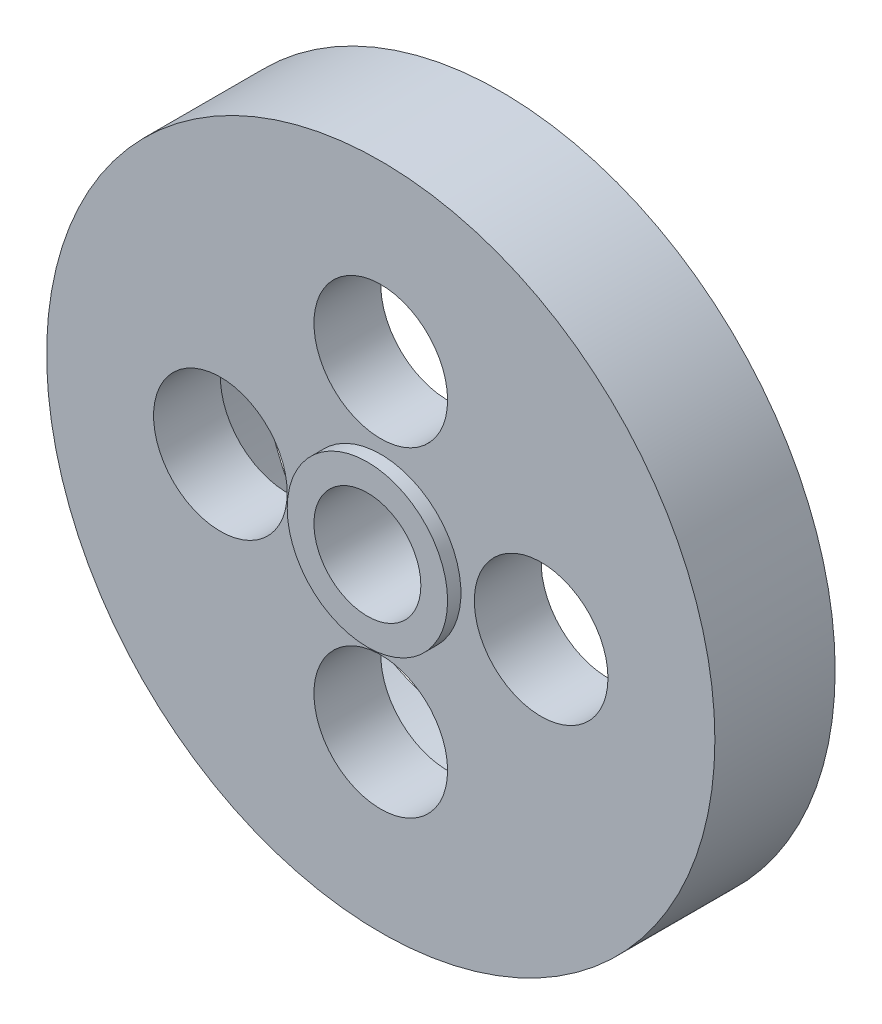
ISO-10303-21;
HEADER;
FILE_DESCRIPTION(('STEP AP214'),'2;1');
FILE_NAME('part.step','',(''),(''),'','','');
FILE_SCHEMA(('AUTOMOTIVE_DESIGN { 1 0 10303 214 1 1 1 1 }'));
ENDSEC;
DATA;
#1=APPLICATION_CONTEXT('core data for automotive mechanical design processes');
#2=APPLICATION_PROTOCOL_DEFINITION('international standard','automotive_design',2000,#1);
#3=PRODUCT_CONTEXT('',#1,'mechanical');
#4=PRODUCT('Part','Part','',(#3));
#5=PRODUCT_RELATED_PRODUCT_CATEGORY('part','',(#4));
#6=PRODUCT_DEFINITION_FORMATION('','',#4);
#7=PRODUCT_DEFINITION_CONTEXT('part definition',#1,'design');
#8=PRODUCT_DEFINITION('design','',#6,#7);
#9=PRODUCT_DEFINITION_SHAPE('','',#8);
#10=(LENGTH_UNIT() NAMED_UNIT(*) SI_UNIT(.MILLI.,.METRE.));
#11=(NAMED_UNIT(*) PLANE_ANGLE_UNIT() SI_UNIT($,.RADIAN.));
#12=(NAMED_UNIT(*) SI_UNIT($,.STERADIAN.) SOLID_ANGLE_UNIT());
#13=UNCERTAINTY_MEASURE_WITH_UNIT(LENGTH_MEASURE(1.E-05),#10,'distance_accuracy_value','');
#14=(GEOMETRIC_REPRESENTATION_CONTEXT(3) GLOBAL_UNCERTAINTY_ASSIGNED_CONTEXT((#13)) GLOBAL_UNIT_ASSIGNED_CONTEXT((#10,
#11,#12)) REPRESENTATION_CONTEXT('',''));
#15=CARTESIAN_POINT('',(0.,0.,0.));
#16=DIRECTION('',(0.,0.,1.));
#17=DIRECTION('',(1.,0.,0.));
#18=AXIS2_PLACEMENT_3D('',#15,#16,#17);
#19=CARTESIAN_POINT('',(0.,4.,-7.73906317836018));
#20=DIRECTION('',(0.,0.,-1.));
#21=DIRECTION('',(-1.,0.,0.));
#22=AXIS2_PLACEMENT_3D('',#19,#20,#21);
#23=PLANE('',#22);
#24=CARTESIAN_POINT('',(0.,0.,-7.73906317836018));
#25=DIRECTION('',(0.,0.,1.));
#26=DIRECTION('',(1.,0.,0.));
#27=AXIS2_PLACEMENT_3D('',#24,#25,#26);
#28=CIRCLE('',#27,25.);
#29=CARTESIAN_POINT('',(25.,0.,-7.73906317836018));
#30=VERTEX_POINT('',#29);
#31=EDGE_CURVE('E50',#30,#30,#28,.T.);
#32=ORIENTED_EDGE('',*,*,#31,.T.);
#33=EDGE_LOOP('',(#32));
#34=FACE_BOUND('',#33,.T.);
#35=CARTESIAN_POINT('',(-12.,0.,-7.73906317836018));
#36=DIRECTION('',(0.,0.,1.));
#37=DIRECTION('',(1.,0.,0.));
#38=AXIS2_PLACEMENT_3D('',#35,#36,#37);
#39=CIRCLE('',#38,5.00000000000015);
#40=CARTESIAN_POINT('',(-6.99999999999989,0.,-7.73906317836018));
#41=VERTEX_POINT('',#40);
#42=EDGE_CURVE('E85',#41,#41,#39,.T.);
#43=ORIENTED_EDGE('',*,*,#42,.F.);
#44=EDGE_LOOP('',(#43));
#45=FACE_BOUND('',#44,.T.);
#46=CARTESIAN_POINT('',(0.,-12.,-7.73906317836018));
#47=DIRECTION('',(0.,0.,1.));
#48=DIRECTION('',(1.,0.,0.));
#49=AXIS2_PLACEMENT_3D('',#46,#47,#48);
#50=CIRCLE('',#49,5.00000000000007);
#51=CARTESIAN_POINT('',(5.00000000000007,-12.,-7.73906317836018));
#52=VERTEX_POINT('',#51);
#53=EDGE_CURVE('E204',#52,#52,#50,.T.);
#54=ORIENTED_EDGE('',*,*,#53,.F.);
#55=EDGE_LOOP('',(#54));
#56=FACE_BOUND('',#55,.T.);
#57=CARTESIAN_POINT('',(12.,0.,-7.73906317836018));
#58=DIRECTION('',(0.,0.,1.));
#59=DIRECTION('',(1.,0.,0.));
#60=AXIS2_PLACEMENT_3D('',#57,#58,#59);
#61=CIRCLE('',#60,5.00000000000004);
#62=CARTESIAN_POINT('',(17.,0.,-7.73906317836018));
#63=VERTEX_POINT('',#62);
#64=EDGE_CURVE('E210',#63,#63,#61,.T.);
#65=ORIENTED_EDGE('',*,*,#64,.F.);
#66=EDGE_LOOP('',(#65));
#67=FACE_BOUND('',#66,.T.);
#68=CARTESIAN_POINT('',(0.,12.,-7.73906317836018));
#69=DIRECTION('',(0.,0.,1.));
#70=DIRECTION('',(1.,0.,0.));
#71=AXIS2_PLACEMENT_3D('',#68,#69,#70);
#72=CIRCLE('',#71,5.);
#73=CARTESIAN_POINT('',(5.,12.,-7.73906317836018));
#74=VERTEX_POINT('',#73);
#75=EDGE_CURVE('E67',#74,#74,#72,.T.);
#76=ORIENTED_EDGE('',*,*,#75,.F.);
#77=EDGE_LOOP('',(#76));
#78=FACE_BOUND('',#77,.T.);
#79=CARTESIAN_POINT('',(0.,0.,-7.73906317836018));
#80=DIRECTION('',(0.,0.,-1.));
#81=DIRECTION('',(-1.,0.,0.));
#82=AXIS2_PLACEMENT_3D('',#79,#80,#81);
#83=CIRCLE('',#82,6.);
#84=CARTESIAN_POINT('',(-6.,0.,-7.73906317836018));
#85=VERTEX_POINT('',#84);
#86=EDGE_CURVE('E10',#85,#85,#83,.F.);
#87=ORIENTED_EDGE('',*,*,#86,.F.);
#88=EDGE_LOOP('',(#87));
#89=FACE_BOUND('',#88,.T.);
#90=ADVANCED_FACE('F43',(#34,#45,#56,#67,#78,#89),#23,.F.);
#91=CARTESIAN_POINT('',(0.,0.,0.));
#92=DIRECTION('',(0.,0.,1.));
#93=DIRECTION('',(1.,0.,0.));
#94=AXIS2_PLACEMENT_3D('',#91,#92,#93);
#95=CYLINDRICAL_SURFACE('',#94,4.);
#96=CARTESIAN_POINT('',(0.,0.,-12.7390631783602));
#97=DIRECTION('',(0.,0.,1.));
#98=DIRECTION('',(1.,0.,0.));
#99=AXIS2_PLACEMENT_3D('',#96,#97,#98);
#100=CIRCLE('',#99,4.);
#101=CARTESIAN_POINT('',(4.,0.,-12.7390631783602));
#102=VERTEX_POINT('',#101);
#103=EDGE_CURVE('E74',#102,#102,#100,.T.);
#104=ORIENTED_EDGE('',*,*,#103,.F.);
#105=EDGE_LOOP('',(#104));
#106=FACE_BOUND('',#105,.T.);
#107=CARTESIAN_POINT('',(0.,0.,-6.73906317836018));
#108=DIRECTION('',(0.,0.,1.));
#109=DIRECTION('',(1.,0.,0.));
#110=AXIS2_PLACEMENT_3D('',#107,#108,#109);
#111=CIRCLE('',#110,4.);
#112=CARTESIAN_POINT('',(4.,0.,-6.73906317836018));
#113=VERTEX_POINT('',#112);
#114=EDGE_CURVE('E201',#113,#113,#111,.T.);
#115=ORIENTED_EDGE('',*,*,#114,.T.);
#116=EDGE_LOOP('',(#115));
#117=FACE_BOUND('',#116,.T.);
#118=ADVANCED_FACE('F45',(#106,#117),#95,.F.);
#119=CARTESIAN_POINT('',(0.,0.,0.));
#120=DIRECTION('',(0.,0.,1.));
#121=DIRECTION('',(1.,0.,0.));
#122=AXIS2_PLACEMENT_3D('',#119,#120,#121);
#123=CYLINDRICAL_SURFACE('',#122,25.);
#124=ORIENTED_EDGE('',*,*,#31,.F.);
#125=EDGE_LOOP('',(#124));
#126=FACE_BOUND('',#125,.T.);
#127=CARTESIAN_POINT('',(0.,0.,-16.7390631783602));
#128=DIRECTION('',(0.,0.,1.));
#129=DIRECTION('',(1.,0.,0.));
#130=AXIS2_PLACEMENT_3D('',#127,#128,#129);
#131=CIRCLE('',#130,25.);
#132=CARTESIAN_POINT('',(25.,0.,-16.7390631783602));
#133=VERTEX_POINT('',#132);
#134=EDGE_CURVE('E54',#133,#133,#131,.T.);
#135=ORIENTED_EDGE('',*,*,#134,.T.);
#136=EDGE_LOOP('',(#135));
#137=FACE_BOUND('',#136,.T.);
#138=ADVANCED_FACE('F115',(#126,#137),#123,.T.);
#139=CARTESIAN_POINT('',(0.,25.,-16.7390631783602));
#140=DIRECTION('',(0.,0.,1.));
#141=DIRECTION('',(1.,0.,0.));
#142=AXIS2_PLACEMENT_3D('',#139,#140,#141);
#143=PLANE('',#142);
#144=ORIENTED_EDGE('',*,*,#134,.F.);
#145=EDGE_LOOP('',(#144));
#146=FACE_BOUND('',#145,.T.);
#147=CARTESIAN_POINT('',(0.,0.,-16.7390631783602));
#148=DIRECTION('',(0.,0.,1.));
#149=DIRECTION('',(1.,0.,0.));
#150=AXIS2_PLACEMENT_3D('',#147,#148,#149);
#151=CIRCLE('',#150,18.);
#152=CARTESIAN_POINT('',(18.,0.,-16.7390631783602));
#153=VERTEX_POINT('',#152);
#154=EDGE_CURVE('E59',#153,#153,#151,.T.);
#155=ORIENTED_EDGE('',*,*,#154,.T.);
#156=EDGE_LOOP('',(#155));
#157=FACE_BOUND('',#156,.T.);
#158=ADVANCED_FACE('F90',(#146,#157),#143,.F.);
#159=CARTESIAN_POINT('',(0.,0.,0.));
#160=DIRECTION('',(0.,0.,1.));
#161=DIRECTION('',(1.,0.,0.));
#162=AXIS2_PLACEMENT_3D('',#159,#160,#161);
#163=CYLINDRICAL_SURFACE('',#162,18.);
#164=ORIENTED_EDGE('',*,*,#154,.F.);
#165=EDGE_LOOP('',(#164));
#166=FACE_BOUND('',#165,.T.);
#167=CARTESIAN_POINT('',(0.,0.,-12.7390631783602));
#168=DIRECTION('',(0.,0.,1.));
#169=DIRECTION('',(1.,0.,0.));
#170=AXIS2_PLACEMENT_3D('',#167,#168,#169);
#171=CIRCLE('',#170,18.);
#172=CARTESIAN_POINT('',(18.,0.,-12.7390631783602));
#173=VERTEX_POINT('',#172);
#174=EDGE_CURVE('E78',#173,#173,#171,.T.);
#175=ORIENTED_EDGE('',*,*,#174,.T.);
#176=EDGE_LOOP('',(#175));
#177=FACE_BOUND('',#176,.T.);
#178=ADVANCED_FACE('F92',(#166,#177),#163,.F.);
#179=CARTESIAN_POINT('',(0.,18.,-12.7390631783602));
#180=DIRECTION('',(0.,0.,1.));
#181=DIRECTION('',(1.,0.,0.));
#182=AXIS2_PLACEMENT_3D('',#179,#180,#181);
#183=PLANE('',#182);
#184=CARTESIAN_POINT('',(0.,12.,-12.7390631783602));
#185=DIRECTION('',(0.,0.,1.));
#186=DIRECTION('',(1.,0.,0.));
#187=AXIS2_PLACEMENT_3D('',#184,#185,#186);
#188=CIRCLE('',#187,5.);
#189=CARTESIAN_POINT('',(5.,12.,-12.7390631783602));
#190=VERTEX_POINT('',#189);
#191=EDGE_CURVE('E72',#190,#190,#188,.T.);
#192=ORIENTED_EDGE('',*,*,#191,.T.);
#193=EDGE_LOOP('',(#192));
#194=FACE_BOUND('',#193,.T.);
#195=CARTESIAN_POINT('',(12.,0.,-12.7390631783602));
#196=DIRECTION('',(0.,0.,1.));
#197=DIRECTION('',(1.,0.,0.));
#198=AXIS2_PLACEMENT_3D('',#195,#196,#197);
#199=CIRCLE('',#198,5.00000000000004);
#200=CARTESIAN_POINT('',(17.,0.,-12.7390631783602));
#201=VERTEX_POINT('',#200);
#202=EDGE_CURVE('E70',#201,#201,#199,.T.);
#203=ORIENTED_EDGE('',*,*,#202,.T.);
#204=EDGE_LOOP('',(#203));
#205=FACE_BOUND('',#204,.T.);
#206=CARTESIAN_POINT('',(0.,-12.,-12.7390631783602));
#207=DIRECTION('',(0.,0.,1.));
#208=DIRECTION('',(1.,0.,0.));
#209=AXIS2_PLACEMENT_3D('',#206,#207,#208);
#210=CIRCLE('',#209,5.00000000000007);
#211=CARTESIAN_POINT('',(5.00000000000007,-12.,-12.7390631783602));
#212=VERTEX_POINT('',#211);
#213=EDGE_CURVE('E66',#212,#212,#210,.T.);
#214=ORIENTED_EDGE('',*,*,#213,.T.);
#215=EDGE_LOOP('',(#214));
#216=FACE_BOUND('',#215,.T.);
#217=CARTESIAN_POINT('',(-12.,0.,-12.7390631783602));
#218=DIRECTION('',(0.,0.,1.));
#219=DIRECTION('',(1.,0.,0.));
#220=AXIS2_PLACEMENT_3D('',#217,#218,#219);
#221=CIRCLE('',#220,5.00000000000015);
#222=CARTESIAN_POINT('',(-6.99999999999989,0.,-12.7390631783602));
#223=VERTEX_POINT('',#222);
#224=EDGE_CURVE('E63',#223,#223,#221,.T.);
#225=ORIENTED_EDGE('',*,*,#224,.T.);
#226=EDGE_LOOP('',(#225));
#227=FACE_BOUND('',#226,.T.);
#228=ORIENTED_EDGE('',*,*,#174,.F.);
#229=EDGE_LOOP('',(#228));
#230=FACE_BOUND('',#229,.T.);
#231=ORIENTED_EDGE('',*,*,#103,.T.);
#232=EDGE_LOOP('',(#231));
#233=FACE_BOUND('',#232,.T.);
#234=ADVANCED_FACE('F95',(#194,#205,#216,#227,#230,#233),#183,.F.);
#235=CARTESIAN_POINT('',(-12.,0.,-16.7390631783602));
#236=DIRECTION('',(0.,0.,1.));
#237=DIRECTION('',(1.,0.,0.));
#238=AXIS2_PLACEMENT_3D('',#235,#236,#237);
#239=CYLINDRICAL_SURFACE('',#238,5.00000000000015);
#240=ORIENTED_EDGE('',*,*,#42,.T.);
#241=EDGE_LOOP('',(#240));
#242=FACE_BOUND('',#241,.T.);
#243=ORIENTED_EDGE('',*,*,#224,.F.);
#244=EDGE_LOOP('',(#243));
#245=FACE_BOUND('',#244,.T.);
#246=ADVANCED_FACE('F100',(#242,#245),#239,.F.);
#247=CARTESIAN_POINT('',(0.,-12.,-16.7390631783602));
#248=DIRECTION('',(0.,0.,1.));
#249=DIRECTION('',(1.,0.,0.));
#250=AXIS2_PLACEMENT_3D('',#247,#248,#249);
#251=CYLINDRICAL_SURFACE('',#250,5.00000000000007);
#252=ORIENTED_EDGE('',*,*,#53,.T.);
#253=EDGE_LOOP('',(#252));
#254=FACE_BOUND('',#253,.T.);
#255=ORIENTED_EDGE('',*,*,#213,.F.);
#256=EDGE_LOOP('',(#255));
#257=FACE_BOUND('',#256,.T.);
#258=ADVANCED_FACE('F106',(#254,#257),#251,.F.);
#259=CARTESIAN_POINT('',(12.,0.,-16.7390631783602));
#260=DIRECTION('',(0.,0.,1.));
#261=DIRECTION('',(1.,0.,0.));
#262=AXIS2_PLACEMENT_3D('',#259,#260,#261);
#263=CYLINDRICAL_SURFACE('',#262,5.00000000000004);
#264=ORIENTED_EDGE('',*,*,#64,.T.);
#265=EDGE_LOOP('',(#264));
#266=FACE_BOUND('',#265,.T.);
#267=ORIENTED_EDGE('',*,*,#202,.F.);
#268=EDGE_LOOP('',(#267));
#269=FACE_BOUND('',#268,.T.);
#270=ADVANCED_FACE('F149',(#266,#269),#263,.F.);
#271=CARTESIAN_POINT('',(0.,12.,-16.7390631783602));
#272=DIRECTION('',(0.,0.,1.));
#273=DIRECTION('',(1.,0.,0.));
#274=AXIS2_PLACEMENT_3D('',#271,#272,#273);
#275=CYLINDRICAL_SURFACE('',#274,5.);
#276=ORIENTED_EDGE('',*,*,#75,.T.);
#277=EDGE_LOOP('',(#276));
#278=FACE_BOUND('',#277,.T.);
#279=ORIENTED_EDGE('',*,*,#191,.F.);
#280=EDGE_LOOP('',(#279));
#281=FACE_BOUND('',#280,.T.);
#282=ADVANCED_FACE('F159',(#278,#281),#275,.F.);
#283=CARTESIAN_POINT('',(0.,0.,-6.73906317836018));
#284=DIRECTION('',(0.,0.,1.));
#285=DIRECTION('',(1.,0.,0.));
#286=AXIS2_PLACEMENT_3D('',#283,#284,#285);
#287=PLANE('',#286);
#288=CARTESIAN_POINT('',(0.,0.,-6.73906317836018));
#289=DIRECTION('',(0.,0.,1.));
#290=DIRECTION('',(1.,0.,0.));
#291=AXIS2_PLACEMENT_3D('',#288,#289,#290);
#292=CIRCLE('',#291,6.);
#293=CARTESIAN_POINT('',(6.,0.,-6.73906317836018));
#294=VERTEX_POINT('',#293);
#295=EDGE_CURVE('E200',#294,#294,#292,.T.);
#296=ORIENTED_EDGE('',*,*,#295,.T.);
#297=EDGE_LOOP('',(#296));
#298=FACE_BOUND('',#297,.T.);
#299=ORIENTED_EDGE('',*,*,#114,.F.);
#300=EDGE_LOOP('',(#299));
#301=FACE_BOUND('',#300,.T.);
#302=ADVANCED_FACE('F167',(#298,#301),#287,.T.);
#303=CARTESIAN_POINT('',(0.,0.,-6.73906317836018));
#304=DIRECTION('',(0.,0.,-1.));
#305=DIRECTION('',(-1.,0.,0.));
#306=AXIS2_PLACEMENT_3D('',#303,#304,#305);
#307=CYLINDRICAL_SURFACE('',#306,6.);
#308=ORIENTED_EDGE('',*,*,#295,.F.);
#309=EDGE_LOOP('',(#308));
#310=FACE_BOUND('',#309,.T.);
#311=ORIENTED_EDGE('',*,*,#86,.T.);
#312=EDGE_LOOP('',(#311));
#313=FACE_BOUND('',#312,.T.);
#314=ADVANCED_FACE('F187',(#310,#313),#307,.T.);
#315=CLOSED_SHELL('',(#90,#118,#138,#158,#178,#234,#246,#258,#270,#282,#302,#314));
#316=MANIFOLD_SOLID_BREP('B2',#315);
#317=ADVANCED_BREP_SHAPE_REPRESENTATION('',(#18,#316),#14);
#318=SHAPE_DEFINITION_REPRESENTATION(#9,#317);
ENDSEC;
END-ISO-10303-21;
